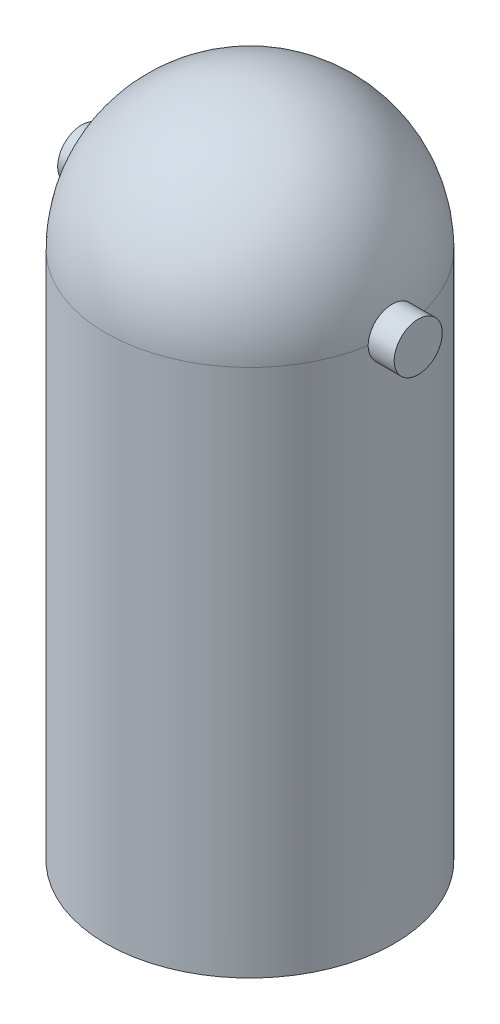
ISO-10303-21;
HEADER;
FILE_DESCRIPTION(('STEP AP214'),'2;1');
FILE_NAME('part.step','',(''),(''),'','','');
FILE_SCHEMA(('AUTOMOTIVE_DESIGN { 1 0 10303 214 1 1 1 1 }'));
ENDSEC;
DATA;
#1=APPLICATION_CONTEXT('core data for automotive mechanical design processes');
#2=APPLICATION_PROTOCOL_DEFINITION('international standard','automotive_design',2000,#1);
#3=PRODUCT_CONTEXT('',#1,'mechanical');
#4=PRODUCT('Part','Part','',(#3));
#5=PRODUCT_RELATED_PRODUCT_CATEGORY('part','',(#4));
#6=PRODUCT_DEFINITION_FORMATION('','',#4);
#7=PRODUCT_DEFINITION_CONTEXT('part definition',#1,'design');
#8=PRODUCT_DEFINITION('design','',#6,#7);
#9=PRODUCT_DEFINITION_SHAPE('','',#8);
#10=(LENGTH_UNIT() NAMED_UNIT(*) SI_UNIT(.MILLI.,.METRE.));
#11=(NAMED_UNIT(*) PLANE_ANGLE_UNIT() SI_UNIT($,.RADIAN.));
#12=(NAMED_UNIT(*) SI_UNIT($,.STERADIAN.) SOLID_ANGLE_UNIT());
#13=UNCERTAINTY_MEASURE_WITH_UNIT(LENGTH_MEASURE(1.E-05),#10,'distance_accuracy_value','');
#14=(GEOMETRIC_REPRESENTATION_CONTEXT(3) GLOBAL_UNCERTAINTY_ASSIGNED_CONTEXT((#13)) GLOBAL_UNIT_ASSIGNED_CONTEXT((#10,
#11,#12)) REPRESENTATION_CONTEXT('',''));
#15=CARTESIAN_POINT('',(0.,0.,0.));
#16=DIRECTION('',(0.,0.,1.));
#17=DIRECTION('',(1.,0.,0.));
#18=AXIS2_PLACEMENT_3D('',#15,#16,#17);
#19=CARTESIAN_POINT('',(0.,110.,0.));
#20=DIRECTION('',(0.,-1.,0.));
#21=DIRECTION('',(0.,0.,-1.));
#22=AXIS2_PLACEMENT_3D('',#19,#20,#21);
#23=CYLINDRICAL_SURFACE('',#22,30.);
#24=CARTESIAN_POINT('',(0.,0.,0.));
#25=DIRECTION('',(0.,1.,0.));
#26=DIRECTION('',(0.,0.,1.));
#27=AXIS2_PLACEMENT_3D('',#24,#25,#26);
#28=CIRCLE('',#27,30.);
#29=CARTESIAN_POINT('',(0.,0.,30.));
#30=VERTEX_POINT('',#29);
#31=EDGE_CURVE('E99',#30,#30,#28,.T.);
#32=ORIENTED_EDGE('',*,*,#31,.T.);
#33=EDGE_LOOP('',(#32));
#34=FACE_BOUND('',#33,.T.);
#35=CARTESIAN_POINT('',(0.,110.,0.));
#36=DIRECTION('',(0.,1.,0.));
#37=DIRECTION('',(0.,0.,1.));
#38=AXIS2_PLACEMENT_3D('',#35,#36,#37);
#39=CIRCLE('',#38,30.);
#40=CARTESIAN_POINT('',(-29.5803989154981,110.,5.00000000000001));
#41=VERTEX_POINT('',#40);
#42=CARTESIAN_POINT('',(29.5803989154981,110.,5.00000000000001));
#43=VERTEX_POINT('',#42);
#44=EDGE_CURVE('E63',#41,#43,#39,.T.);
#45=ORIENTED_EDGE('',*,*,#44,.F.);
#46=CARTESIAN_POINT('',(-29.5803989154981,110.,5.));
#47=CARTESIAN_POINT('',(-29.5803886592913,109.860414055131,5.00001619656643));
#48=CARTESIAN_POINT('',(-29.58138659829,109.720831757134,4.99415542976002));
#49=CARTESIAN_POINT('',(-29.5853245142764,109.442685215315,4.97079796468969));
#50=CARTESIAN_POINT('',(-29.5882642968779,109.304120870995,4.95330243111043));
#51=CARTESIAN_POINT('',(-29.5960066510669,109.029167529677,4.90682294566924));
#52=CARTESIAN_POINT('',(-29.6008068498959,108.892775991261,4.87785362634465));
#53=CARTESIAN_POINT('',(-29.6121274944237,108.622954768815,4.80865277914443));
#54=CARTESIAN_POINT('',(-29.6186479383967,108.489525081815,4.76842126256705));
#55=CARTESIAN_POINT('',(-29.6332220642446,108.226559753299,4.67699567846272));
#56=CARTESIAN_POINT('',(-29.6412757821762,108.097024203443,4.6258013531283));
#57=CARTESIAN_POINT('',(-29.6586891800007,107.842699387654,4.5128066090275));
#58=CARTESIAN_POINT('',(-29.6680493423655,107.717911896952,4.45100227001811));
#59=CARTESIAN_POINT('',(-29.6878046407213,107.474032148569,4.31726996235811));
#60=CARTESIAN_POINT('',(-29.6981993932031,107.354937804566,4.24534574095835));
#61=CARTESIAN_POINT('',(-29.719739232635,107.123157583229,4.09183420531909));
#62=CARTESIAN_POINT('',(-29.7308845979711,107.010474112452,4.01024329730177));
#63=CARTESIAN_POINT('',(-29.7537069801807,106.791410360904,3.83726364829096));
#64=CARTESIAN_POINT('',(-29.7653876582989,106.68509054554,3.74579880761745));
#65=CARTESIAN_POINT('',(-29.7888689929779,106.480475660167,3.55423644669736));
#66=CARTESIAN_POINT('',(-29.8006696923601,106.382183575934,3.45413574269843));
#67=CARTESIAN_POINT('',(-29.8240537837347,106.194363750263,3.24603965806015));
#68=CARTESIAN_POINT('',(-29.8356372215544,106.104834143346,3.1380459663806));
#69=CARTESIAN_POINT('',(-29.8582698508863,105.935106712698,2.91484247034157));
#70=CARTESIAN_POINT('',(-29.8693188438333,105.854912342007,2.79963001989934));
#71=CARTESIAN_POINT('',(-29.8906284650519,105.704038993081,2.5621512184055));
#72=CARTESIAN_POINT('',(-29.900884333207,105.633415801985,2.43984898629586));
#73=CARTESIAN_POINT('',(-29.9202514537875,105.502708812627,2.18959084540147));
#74=CARTESIAN_POINT('',(-29.929362278382,105.442628950443,2.06163284740667));
#75=CARTESIAN_POINT('',(-29.9461712614415,105.333515204461,1.80107130321759));
#76=CARTESIAN_POINT('',(-29.953870092492,105.284476059008,1.6684700048373));
#77=CARTESIAN_POINT('',(-29.9676431888474,105.197764019398,1.39946840409619));
#78=CARTESIAN_POINT('',(-29.9737168625589,105.160095263677,1.26306673821292));
#79=CARTESIAN_POINT('',(-29.9840106699774,105.096748638376,0.988801683471316));
#80=CARTESIAN_POINT('',(-29.9882479912101,105.070959430843,0.850964788305787));
#81=CARTESIAN_POINT('',(-29.9948387133015,105.031026092699,0.57357354335315));
#82=CARTESIAN_POINT('',(-29.9971914595796,105.016886008197,0.434018613905338));
#83=CARTESIAN_POINT('',(-30.0012919678289,104.992200554601,0.0142912259986259));
#84=CARTESIAN_POINT('',(-30.0000939167392,104.99931845338,-0.267254235436036));
#85=CARTESIAN_POINT('',(-29.9925288928666,105.045014921183,-0.683756707314432));
#86=CARTESIAN_POINT('',(-29.9890741345357,105.065912567164,-0.821017942341435));
#87=CARTESIAN_POINT('',(-29.9803802958108,105.119024282304,-1.09327967954601));
#88=CARTESIAN_POINT('',(-29.9751418355436,105.151234418654,-1.22828095033836));
#89=CARTESIAN_POINT('',(-29.9630193468665,105.226750931964,-1.4951055630251));
#90=CARTESIAN_POINT('',(-29.9561347207802,105.27006133953,-1.62692773149629));
#91=CARTESIAN_POINT('',(-29.9409145422369,105.367433097551,-1.88640253905997));
#92=CARTESIAN_POINT('',(-29.9325795018485,105.421490654681,-2.01405663086426));
#93=CARTESIAN_POINT('',(-29.9146408686773,105.540269132922,-2.26498699463601));
#94=CARTESIAN_POINT('',(-29.9050311983735,105.605041533771,-2.38823845705797));
#95=CARTESIAN_POINT('',(-29.884844317773,105.744570368702,-2.62881105083724));
#96=CARTESIAN_POINT('',(-29.8742674518967,105.819323253041,-2.74613427032621));
#97=CARTESIAN_POINT('',(-29.8524297121551,105.978338416782,-2.97414945693836));
#98=CARTESIAN_POINT('',(-29.8411685723865,106.062604403954,-3.08483881257645));
#99=CARTESIAN_POINT('',(-29.8182795355432,106.240009770673,-3.29875355047044));
#100=CARTESIAN_POINT('',(-29.8066517700975,106.333145989288,-3.40198156870203));
#101=CARTESIAN_POINT('',(-29.7832005261463,106.528892253358,-3.60155360319429));
#102=CARTESIAN_POINT('',(-29.77137640825,106.631605420065,-3.69779642974689));
#103=CARTESIAN_POINT('',(-29.748014076751,106.844757273325,-3.88126395358928));
#104=CARTESIAN_POINT('',(-29.7364757610334,106.955193145085,-3.96849190821575));
#105=CARTESIAN_POINT('',(-29.7140006020952,107.1831398732,-4.13341281868771));
#106=CARTESIAN_POINT('',(-29.7030641628837,107.300655373534,-4.21109941196698));
#107=CARTESIAN_POINT('',(-29.6821182229139,107.541836798371,-4.35628717941041));
#108=CARTESIAN_POINT('',(-29.6721083728449,107.665500377891,-4.42379219796931));
#109=CARTESIAN_POINT('',(-29.6532803366629,107.918421543981,-4.54828975070812));
#110=CARTESIAN_POINT('',(-29.6444646825773,108.047690272488,-4.6052600388308));
#111=CARTESIAN_POINT('',(-29.6283110203994,108.310615130521,-4.70806699644137));
#112=CARTESIAN_POINT('',(-29.6209724420521,108.444269543597,-4.75390796404386));
#113=CARTESIAN_POINT('',(-29.6079923491917,108.714908345912,-4.83409129312674));
#114=CARTESIAN_POINT('',(-29.6023490474866,108.851889062614,-4.86844576822997));
#115=CARTESIAN_POINT('',(-29.59291890943,109.128272206774,-4.92544270933771));
#116=CARTESIAN_POINT('',(-29.5891311822847,109.267673438883,-4.94809079544189));
#117=CARTESIAN_POINT('',(-29.5843586209559,109.506097046134,-4.97653160196526));
#118=CARTESIAN_POINT('',(-29.5828747341596,109.604760696608,-4.98533693995386));
#119=CARTESIAN_POINT('',(-29.5808945954319,109.802279746962,-4.9970675285378));
#120=CARTESIAN_POINT('',(-29.5803966825715,109.901134543094,-5.00000266789968));
#121=CARTESIAN_POINT('',(-29.5803989154981,110.,-5.));
#122=B_SPLINE_CURVE_WITH_KNOTS('',3,(#46,#47,#48,#49,#50,#51,#52,#53,#54,#55,#56,#57,#58,#59,
#60,#61,#62,#63,#64,#65,#66,#67,#68,#69,#70,#71,#72,#73,#74,#75,#76,#77,#78,#79,#80,#81,#82,#83,
#84,#85,#86,#87,#88,#89,#90,#91,#92,#93,#94,#95,#96,#97,#98,#99,#100,#101,#102,#103,#104,#105,
#106,#107,#108,#109,#110,#111,#112,#113,#114,#115,#116,#117,#118,#119,#120,#121),.UNSPECIFIED.,
.F.,.F.,(4,2,2,2,2,2,2,2,2,2,2,2,2,2,2,2,2,2,2,2,2,2,2,2,2,2,2,2,2,2,2,2,2,2,2,2,2,4),(0.,
0.418625865065224,0.837209830386392,1.25526168494275,1.67331312011094,2.09137438748775,
2.50959045608788,2.92765207069176,3.34586959839038,3.76757807719319,4.18944269558863,
4.61121730522769,5.03314743395931,5.45743980605462,5.88189024122189,6.30613796663066,
6.73053991816564,7.15087902268024,7.57136406281521,8.41138957012547,8.827679478679,
9.2438248062221,9.66012145442151,10.0762714262222,10.4944821881136,10.9125445999294,
11.3307705194755,11.7488479566573,12.1721075947776,12.5952137581535,13.0186005513677,
13.4418270783333,13.8659373683623,14.2898836066228,14.7133813316902,15.1366755511947,
15.433706910413,15.7302374763231),.UNSPECIFIED.);
#123=CARTESIAN_POINT('',(-29.5803989154981,110.,-5.00000000000001));
#124=VERTEX_POINT('',#123);
#125=EDGE_CURVE('E66',#41,#124,#122,.T.);
#126=ORIENTED_EDGE('',*,*,#125,.T.);
#127=CARTESIAN_POINT('',(29.5803989154981,110.,-5.00000000000001));
#128=VERTEX_POINT('',#127);
#129=EDGE_CURVE('E59',#128,#124,#39,.T.);
#130=ORIENTED_EDGE('',*,*,#129,.F.);
#131=CARTESIAN_POINT('',(29.5803989154981,110.,5.));
#132=CARTESIAN_POINT('',(29.5803886592913,109.860414055131,5.00001619656643));
#133=CARTESIAN_POINT('',(29.58138659829,109.720831757134,4.99415542976002));
#134=CARTESIAN_POINT('',(29.5853245142764,109.442685215315,4.97079796468969));
#135=CARTESIAN_POINT('',(29.5882642968779,109.304120870995,4.95330243111043));
#136=CARTESIAN_POINT('',(29.5960066510669,109.029167529677,4.90682294566924));
#137=CARTESIAN_POINT('',(29.6008068498959,108.892775991261,4.87785362634465));
#138=CARTESIAN_POINT('',(29.6121274944237,108.622954768815,4.80865277914443));
#139=CARTESIAN_POINT('',(29.6186479383967,108.489525081815,4.76842126256705));
#140=CARTESIAN_POINT('',(29.6332220642446,108.226559753299,4.67699567846272));
#141=CARTESIAN_POINT('',(29.6412757821762,108.097024203443,4.6258013531283));
#142=CARTESIAN_POINT('',(29.6586891800007,107.842699387654,4.5128066090275));
#143=CARTESIAN_POINT('',(29.6680493423655,107.717911896952,4.45100227001811));
#144=CARTESIAN_POINT('',(29.6878046407213,107.474032148569,4.31726996235811));
#145=CARTESIAN_POINT('',(29.6981993932031,107.354937804566,4.24534574095835));
#146=CARTESIAN_POINT('',(29.719739232635,107.123157583229,4.09183420531909));
#147=CARTESIAN_POINT('',(29.7308845979711,107.010474112452,4.01024329730177));
#148=CARTESIAN_POINT('',(29.7537069801807,106.791410360904,3.83726364829096));
#149=CARTESIAN_POINT('',(29.7653876582989,106.68509054554,3.74579880761745));
#150=CARTESIAN_POINT('',(29.7888689929779,106.480475660167,3.55423644669736));
#151=CARTESIAN_POINT('',(29.8006696923601,106.382183575934,3.45413574269843));
#152=CARTESIAN_POINT('',(29.8240537837347,106.194363750263,3.24603965806015));
#153=CARTESIAN_POINT('',(29.8356372215544,106.104834143346,3.1380459663806));
#154=CARTESIAN_POINT('',(29.8582698508863,105.935106712698,2.91484247034157));
#155=CARTESIAN_POINT('',(29.8693188438333,105.854912342007,2.79963001989934));
#156=CARTESIAN_POINT('',(29.8906284650519,105.704038993081,2.5621512184055));
#157=CARTESIAN_POINT('',(29.900884333207,105.633415801985,2.43984898629586));
#158=CARTESIAN_POINT('',(29.9202514537875,105.502708812627,2.18959084540147));
#159=CARTESIAN_POINT('',(29.929362278382,105.442628950443,2.06163284740667));
#160=CARTESIAN_POINT('',(29.9461712614415,105.333515204461,1.80107130321759));
#161=CARTESIAN_POINT('',(29.953870092492,105.284476059008,1.6684700048373));
#162=CARTESIAN_POINT('',(29.9676431888474,105.197764019398,1.39946840409619));
#163=CARTESIAN_POINT('',(29.9737168625589,105.160095263677,1.26306673821292));
#164=CARTESIAN_POINT('',(29.9840106699774,105.096748638376,0.988801683471316));
#165=CARTESIAN_POINT('',(29.9882479912101,105.070959430843,0.850964788305787));
#166=CARTESIAN_POINT('',(29.9948387133015,105.031026092699,0.57357354335315));
#167=CARTESIAN_POINT('',(29.9971914595796,105.016886008197,0.434018613905338));
#168=CARTESIAN_POINT('',(30.0012919678289,104.992200554601,0.0142912259986259));
#169=CARTESIAN_POINT('',(30.0000939167392,104.99931845338,-0.267254235436036));
#170=CARTESIAN_POINT('',(29.9925288928666,105.045014921183,-0.683756707314432));
#171=CARTESIAN_POINT('',(29.9890741345357,105.065912567164,-0.821017942341435));
#172=CARTESIAN_POINT('',(29.9803802958108,105.119024282304,-1.09327967954601));
#173=CARTESIAN_POINT('',(29.9751418355436,105.151234418654,-1.22828095033836));
#174=CARTESIAN_POINT('',(29.9630193468665,105.226750931964,-1.4951055630251));
#175=CARTESIAN_POINT('',(29.9561347207802,105.27006133953,-1.62692773149629));
#176=CARTESIAN_POINT('',(29.9409145422369,105.367433097551,-1.88640253905997));
#177=CARTESIAN_POINT('',(29.9325795018485,105.421490654681,-2.01405663086426));
#178=CARTESIAN_POINT('',(29.9146408686773,105.540269132922,-2.26498699463601));
#179=CARTESIAN_POINT('',(29.9050311983735,105.605041533771,-2.38823845705797));
#180=CARTESIAN_POINT('',(29.884844317773,105.744570368702,-2.62881105083724));
#181=CARTESIAN_POINT('',(29.8742674518967,105.819323253041,-2.74613427032621));
#182=CARTESIAN_POINT('',(29.8524297121551,105.978338416782,-2.97414945693836));
#183=CARTESIAN_POINT('',(29.8411685723865,106.062604403954,-3.08483881257645));
#184=CARTESIAN_POINT('',(29.8182795355432,106.240009770673,-3.29875355047044));
#185=CARTESIAN_POINT('',(29.8066517700975,106.333145989288,-3.40198156870203));
#186=CARTESIAN_POINT('',(29.7832005261463,106.528892253358,-3.60155360319429));
#187=CARTESIAN_POINT('',(29.77137640825,106.631605420065,-3.69779642974689));
#188=CARTESIAN_POINT('',(29.748014076751,106.844757273325,-3.88126395358928));
#189=CARTESIAN_POINT('',(29.7364757610334,106.955193145085,-3.96849190821575));
#190=CARTESIAN_POINT('',(29.7140006020952,107.1831398732,-4.13341281868771));
#191=CARTESIAN_POINT('',(29.7030641628837,107.300655373534,-4.21109941196698));
#192=CARTESIAN_POINT('',(29.6821182229139,107.541836798371,-4.35628717941041));
#193=CARTESIAN_POINT('',(29.6721083728449,107.665500377891,-4.42379219796931));
#194=CARTESIAN_POINT('',(29.6532803366629,107.918421543981,-4.54828975070812));
#195=CARTESIAN_POINT('',(29.6444646825773,108.047690272488,-4.6052600388308));
#196=CARTESIAN_POINT('',(29.6283110203994,108.310615130521,-4.70806699644137));
#197=CARTESIAN_POINT('',(29.6209724420521,108.444269543597,-4.75390796404386));
#198=CARTESIAN_POINT('',(29.6079923491917,108.714908345912,-4.83409129312674));
#199=CARTESIAN_POINT('',(29.6023490474866,108.851889062614,-4.86844576822997));
#200=CARTESIAN_POINT('',(29.59291890943,109.128272206774,-4.92544270933771));
#201=CARTESIAN_POINT('',(29.5891311822847,109.267673438883,-4.94809079544189));
#202=CARTESIAN_POINT('',(29.5843586209559,109.506097046134,-4.97653160196526));
#203=CARTESIAN_POINT('',(29.5828747341596,109.604760696608,-4.98533693995386));
#204=CARTESIAN_POINT('',(29.5808945954319,109.802279746962,-4.9970675285378));
#205=CARTESIAN_POINT('',(29.5803966825715,109.901134543094,-5.00000266789968));
#206=CARTESIAN_POINT('',(29.5803989154981,110.,-5.));
#207=B_SPLINE_CURVE_WITH_KNOTS('',3,(#131,#132,#133,#134,#135,#136,#137,#138,#139,#140,#141,
#142,#143,#144,#145,#146,#147,#148,#149,#150,#151,#152,#153,#154,#155,#156,#157,#158,#159,#160,
#161,#162,#163,#164,#165,#166,#167,#168,#169,#170,#171,#172,#173,#174,#175,#176,#177,#178,#179,
#180,#181,#182,#183,#184,#185,#186,#187,#188,#189,#190,#191,#192,#193,#194,#195,#196,#197,#198,
#199,#200,#201,#202,#203,#204,#205,#206),.UNSPECIFIED.,.F.,.F.,(4,2,2,2,2,2,2,2,2,2,2,2,2,2,2,2,
2,2,2,2,2,2,2,2,2,2,2,2,2,2,2,2,2,2,2,2,2,4),(0.,0.418625865065224,0.837209830386392,
1.25526168494275,1.67331312011094,2.09137438748775,2.50959045608788,2.92765207069176,
3.34586959839038,3.76757807719319,4.18944269558863,4.61121730522769,5.03314743395931,
5.45743980605462,5.88189024122189,6.30613796663066,6.73053991816564,7.15087902268024,
7.57136406281521,8.41138957012547,8.827679478679,9.2438248062221,9.66012145442151,
10.0762714262222,10.4944821881136,10.9125445999294,11.3307705194755,11.7488479566573,
12.1721075947776,12.5952137581535,13.0186005513677,13.4418270783333,13.8659373683623,
14.2898836066228,14.7133813316902,15.1366755511947,15.433706910413,15.7302374763231),.UNSPECIFIED.);
#208=EDGE_CURVE('E53',#43,#128,#207,.T.);
#209=ORIENTED_EDGE('',*,*,#208,.F.);
#210=EDGE_LOOP('',(#45,#126,#130,#209));
#211=FACE_BOUND('',#210,.T.);
#212=ADVANCED_FACE('F33',(#34,#211),#23,.T.);
#213=CARTESIAN_POINT('',(0.,110.,0.));
#214=DIRECTION('',(-1.,0.,0.));
#215=DIRECTION('',(0.,-1.,0.));
#216=AXIS2_PLACEMENT_3D('',#213,#214,#215);
#217=SPHERICAL_SURFACE('',#216,30.);
#218=CARTESIAN_POINT('',(-29.5803989154981,110.,0.));
#219=DIRECTION('',(1.,0.,0.));
#220=DIRECTION('',(0.,0.,-1.));
#221=AXIS2_PLACEMENT_3D('',#218,#219,#220);
#222=CIRCLE('',#221,5.);
#223=EDGE_CURVE('E11',#41,#124,#222,.F.);
#224=ORIENTED_EDGE('',*,*,#223,.F.);
#225=ORIENTED_EDGE('',*,*,#44,.T.);
#226=CARTESIAN_POINT('',(29.5803989154981,110.,0.));
#227=DIRECTION('',(-1.,0.,0.));
#228=DIRECTION('',(0.,0.,1.));
#229=AXIS2_PLACEMENT_3D('',#226,#227,#228);
#230=CIRCLE('',#229,5.);
#231=EDGE_CURVE('E41',#43,#128,#230,.T.);
#232=ORIENTED_EDGE('',*,*,#231,.T.);
#233=ORIENTED_EDGE('',*,*,#129,.T.);
#234=EDGE_LOOP('',(#224,#225,#232,#233));
#235=FACE_BOUND('',#234,.T.);
#236=ADVANCED_FACE('F61',(#235),#217,.T.);
#237=CARTESIAN_POINT('',(0.,0.,0.));
#238=DIRECTION('',(0.,1.,0.));
#239=DIRECTION('',(0.,0.,1.));
#240=AXIS2_PLACEMENT_3D('',#237,#238,#239);
#241=PLANE('',#240);
#242=CARTESIAN_POINT('',(0.,0.,0.));
#243=DIRECTION('',(0.,-1.,0.));
#244=DIRECTION('',(0.,0.,-1.));
#245=AXIS2_PLACEMENT_3D('',#242,#243,#244);
#246=CIRCLE('',#245,20.);
#247=CARTESIAN_POINT('',(0.,0.,-20.));
#248=VERTEX_POINT('',#247);
#249=EDGE_CURVE('E104',#248,#248,#246,.T.);
#250=ORIENTED_EDGE('',*,*,#249,.F.);
#251=EDGE_LOOP('',(#250));
#252=FACE_BOUND('',#251,.T.);
#253=ORIENTED_EDGE('',*,*,#31,.F.);
#254=EDGE_LOOP('',(#253));
#255=FACE_BOUND('',#254,.T.);
#256=ADVANCED_FACE('F95',(#252,#255),#241,.F.);
#257=CARTESIAN_POINT('',(0.,100.,0.));
#258=DIRECTION('',(0.,-1.,0.));
#259=DIRECTION('',(0.,0.,-1.));
#260=AXIS2_PLACEMENT_3D('',#257,#258,#259);
#261=CYLINDRICAL_SURFACE('',#260,20.);
#262=CARTESIAN_POINT('',(0.,100.,0.));
#263=DIRECTION('',(0.,-1.,0.));
#264=DIRECTION('',(0.,0.,-1.));
#265=AXIS2_PLACEMENT_3D('',#262,#263,#264);
#266=CIRCLE('',#265,20.);
#267=CARTESIAN_POINT('',(0.,100.,-20.));
#268=VERTEX_POINT('',#267);
#269=EDGE_CURVE('E101',#268,#268,#266,.T.);
#270=ORIENTED_EDGE('',*,*,#269,.F.);
#271=EDGE_LOOP('',(#270));
#272=FACE_BOUND('',#271,.T.);
#273=ORIENTED_EDGE('',*,*,#249,.T.);
#274=EDGE_LOOP('',(#273));
#275=FACE_BOUND('',#274,.T.);
#276=ADVANCED_FACE('F122',(#272,#275),#261,.F.);
#277=CARTESIAN_POINT('',(0.,100.,0.));
#278=DIRECTION('',(0.,-1.,0.));
#279=DIRECTION('',(0.,0.,-1.));
#280=AXIS2_PLACEMENT_3D('',#277,#278,#279);
#281=PLANE('',#280);
#282=ORIENTED_EDGE('',*,*,#269,.T.);
#283=EDGE_LOOP('',(#282));
#284=FACE_BOUND('',#283,.T.);
#285=ADVANCED_FACE('F118',(#284),#281,.T.);
#286=CARTESIAN_POINT('',(35.,110.,0.));
#287=DIRECTION('',(-1.,0.,0.));
#288=DIRECTION('',(0.,0.,1.));
#289=AXIS2_PLACEMENT_3D('',#286,#287,#288);
#290=CYLINDRICAL_SURFACE('',#289,5.);
#291=CARTESIAN_POINT('',(35.,110.,0.));
#292=DIRECTION('',(1.,0.,0.));
#293=DIRECTION('',(0.,0.,-1.));
#294=AXIS2_PLACEMENT_3D('',#291,#292,#293);
#295=CIRCLE('',#294,5.);
#296=CARTESIAN_POINT('',(35.,110.,-5.));
#297=VERTEX_POINT('',#296);
#298=EDGE_CURVE('E68',#297,#297,#295,.T.);
#299=ORIENTED_EDGE('',*,*,#298,.F.);
#300=EDGE_LOOP('',(#299));
#301=FACE_BOUND('',#300,.T.);
#302=ORIENTED_EDGE('',*,*,#231,.F.);
#303=ORIENTED_EDGE('',*,*,#208,.T.);
#304=EDGE_LOOP('',(#302,#303));
#305=FACE_BOUND('',#304,.T.);
#306=ADVANCED_FACE('F83',(#301,#305),#290,.T.);
#307=CARTESIAN_POINT('',(35.,110.,0.));
#308=DIRECTION('',(1.,0.,0.));
#309=DIRECTION('',(0.,0.,-1.));
#310=AXIS2_PLACEMENT_3D('',#307,#308,#309);
#311=PLANE('',#310);
#312=ORIENTED_EDGE('',*,*,#298,.T.);
#313=EDGE_LOOP('',(#312));
#314=FACE_BOUND('',#313,.T.);
#315=ADVANCED_FACE('F74',(#314),#311,.T.);
#316=CARTESIAN_POINT('',(-35.,110.,0.));
#317=DIRECTION('',(1.,0.,0.));
#318=DIRECTION('',(0.,0.,-1.));
#319=AXIS2_PLACEMENT_3D('',#316,#317,#318);
#320=CYLINDRICAL_SURFACE('',#319,5.);
#321=CARTESIAN_POINT('',(-35.,110.,0.));
#322=DIRECTION('',(1.,0.,0.));
#323=DIRECTION('',(0.,0.,-1.));
#324=AXIS2_PLACEMENT_3D('',#321,#322,#323);
#325=CIRCLE('',#324,5.);
#326=CARTESIAN_POINT('',(-35.,110.,-5.));
#327=VERTEX_POINT('',#326);
#328=EDGE_CURVE('E69',#327,#327,#325,.T.);
#329=ORIENTED_EDGE('',*,*,#328,.T.);
#330=EDGE_LOOP('',(#329));
#331=FACE_BOUND('',#330,.T.);
#332=ORIENTED_EDGE('',*,*,#125,.F.);
#333=ORIENTED_EDGE('',*,*,#223,.T.);
#334=EDGE_LOOP('',(#332,#333));
#335=FACE_BOUND('',#334,.T.);
#336=ADVANCED_FACE('F71',(#331,#335),#320,.T.);
#337=CARTESIAN_POINT('',(-35.,110.,0.));
#338=DIRECTION('',(-1.,0.,0.));
#339=DIRECTION('',(0.,0.,-1.));
#340=AXIS2_PLACEMENT_3D('',#337,#338,#339);
#341=PLANE('',#340);
#342=ORIENTED_EDGE('',*,*,#328,.F.);
#343=EDGE_LOOP('',(#342));
#344=FACE_BOUND('',#343,.T.);
#345=ADVANCED_FACE('F73',(#344),#341,.T.);
#346=CLOSED_SHELL('',(#212,#236,#256,#276,#285,#306,#315,#336,#345));
#347=MANIFOLD_SOLID_BREP('B2',#346);
#348=ADVANCED_BREP_SHAPE_REPRESENTATION('',(#18,#347),#14);
#349=SHAPE_DEFINITION_REPRESENTATION(#9,#348);
ENDSEC;
END-ISO-10303-21;
